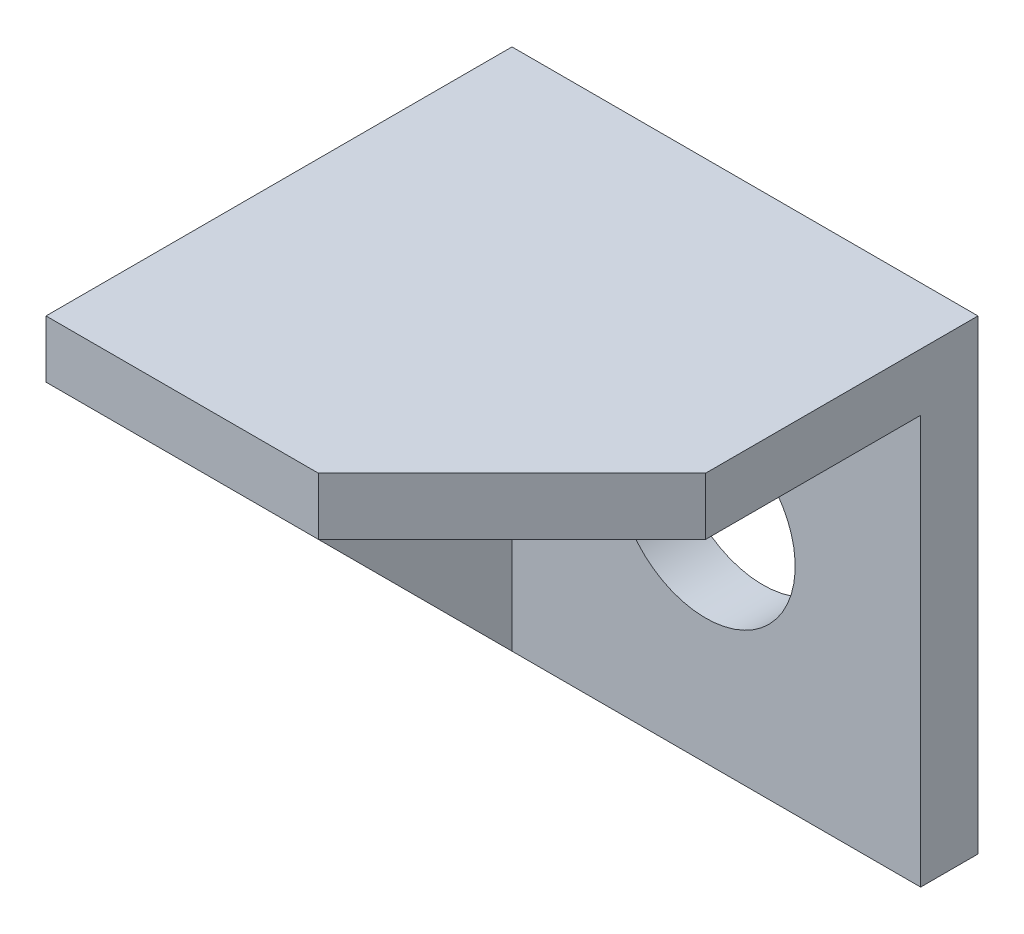
ISO-10303-21;
HEADER;
FILE_DESCRIPTION(('STEP AP214'),'2;1');
FILE_NAME('part.step','',(''),(''),'','','');
FILE_SCHEMA(('AUTOMOTIVE_DESIGN { 1 0 10303 214 1 1 1 1 }'));
ENDSEC;
DATA;
#1=APPLICATION_CONTEXT('core data for automotive mechanical design processes');
#2=APPLICATION_PROTOCOL_DEFINITION('international standard','automotive_design',2000,#1);
#3=PRODUCT_CONTEXT('',#1,'mechanical');
#4=PRODUCT('Part','Part','',(#3));
#5=PRODUCT_RELATED_PRODUCT_CATEGORY('part','',(#4));
#6=PRODUCT_DEFINITION_FORMATION('','',#4);
#7=PRODUCT_DEFINITION_CONTEXT('part definition',#1,'design');
#8=PRODUCT_DEFINITION('design','',#6,#7);
#9=PRODUCT_DEFINITION_SHAPE('','',#8);
#10=(LENGTH_UNIT() NAMED_UNIT(*) SI_UNIT(.MILLI.,.METRE.));
#11=(NAMED_UNIT(*) PLANE_ANGLE_UNIT() SI_UNIT($,.RADIAN.));
#12=(NAMED_UNIT(*) SI_UNIT($,.STERADIAN.) SOLID_ANGLE_UNIT());
#13=UNCERTAINTY_MEASURE_WITH_UNIT(LENGTH_MEASURE(1.E-05),#10,'distance_accuracy_value','');
#14=(GEOMETRIC_REPRESENTATION_CONTEXT(3) GLOBAL_UNCERTAINTY_ASSIGNED_CONTEXT((#13)) GLOBAL_UNIT_ASSIGNED_CONTEXT((#10,
#11,#12)) REPRESENTATION_CONTEXT('',''));
#15=CARTESIAN_POINT('',(0.,0.,0.));
#16=DIRECTION('',(0.,0.,1.));
#17=DIRECTION('',(1.,0.,0.));
#18=AXIS2_PLACEMENT_3D('',#15,#16,#17);
#19=CARTESIAN_POINT('',(32.5,-32.5,65.));
#20=DIRECTION('',(-1.,0.,0.));
#21=DIRECTION('',(0.,0.,1.));
#22=AXIS2_PLACEMENT_3D('',#19,#20,#21);
#23=PLANE('',#22);
#24=DIRECTION('',(0.,0.,-1.));
#25=VECTOR('',#24,1.);
#26=CARTESIAN_POINT('',(32.5,32.5,65.));
#27=LINE('',#26,#25);
#28=CARTESIAN_POINT('',(32.5,32.5,37.9999999999999));
#29=VERTEX_POINT('',#28);
#30=CARTESIAN_POINT('',(32.5,32.5,0.));
#31=VERTEX_POINT('',#30);
#32=EDGE_CURVE('E13',#29,#31,#27,.T.);
#33=ORIENTED_EDGE('',*,*,#32,.F.);
#34=DIRECTION('',(0.,-1.,0.));
#35=VECTOR('',#34,1.);
#36=CARTESIAN_POINT('',(32.5,32.5,37.9999999999999));
#37=LINE('',#36,#35);
#38=CARTESIAN_POINT('',(32.5,24.5,37.9999999999999));
#39=VERTEX_POINT('',#38);
#40=EDGE_CURVE('E181',#29,#39,#37,.T.);
#41=ORIENTED_EDGE('',*,*,#40,.T.);
#42=DIRECTION('',(0.,0.,1.));
#43=VECTOR('',#42,1.);
#44=CARTESIAN_POINT('',(32.5,24.5,8.));
#45=LINE('',#44,#43);
#46=CARTESIAN_POINT('',(32.5,24.5,8.));
#47=VERTEX_POINT('',#46);
#48=EDGE_CURVE('E216',#47,#39,#45,.T.);
#49=ORIENTED_EDGE('',*,*,#48,.F.);
#50=DIRECTION('',(0.,1.,0.));
#51=VECTOR('',#50,1.);
#52=CARTESIAN_POINT('',(32.5,24.5,8.));
#53=LINE('',#52,#51);
#54=CARTESIAN_POINT('',(32.5,-32.5,8.));
#55=VERTEX_POINT('',#54);
#56=EDGE_CURVE('E151',#55,#47,#53,.T.);
#57=ORIENTED_EDGE('',*,*,#56,.F.);
#58=DIRECTION('',(0.,0.,-1.));
#59=VECTOR('',#58,1.);
#60=CARTESIAN_POINT('',(32.5,-32.5,65.));
#61=LINE('',#60,#59);
#62=CARTESIAN_POINT('',(32.5,-32.5,0.));
#63=VERTEX_POINT('',#62);
#64=EDGE_CURVE('E107',#55,#63,#61,.T.);
#65=ORIENTED_EDGE('',*,*,#64,.T.);
#66=DIRECTION('',(0.,1.,0.));
#67=VECTOR('',#66,1.);
#68=CARTESIAN_POINT('',(32.5,-32.5,0.));
#69=LINE('',#68,#67);
#70=EDGE_CURVE('E121',#63,#31,#69,.T.);
#71=ORIENTED_EDGE('',*,*,#70,.T.);
#72=EDGE_LOOP('',(#33,#41,#49,#57,#65,#71));
#73=FACE_BOUND('',#72,.T.);
#74=ADVANCED_FACE('F51',(#73),#23,.F.);
#75=CARTESIAN_POINT('',(-32.5,32.5,65.));
#76=DIRECTION('',(0.,-1.,0.));
#77=DIRECTION('',(0.,0.,-1.));
#78=AXIS2_PLACEMENT_3D('',#75,#76,#77);
#79=PLANE('',#78);
#80=DIRECTION('',(-1.,0.,0.));
#81=VECTOR('',#80,1.);
#82=CARTESIAN_POINT('',(-32.5,32.5,65.));
#83=LINE('',#82,#81);
#84=CARTESIAN_POINT('',(5.5,32.5,65.));
#85=VERTEX_POINT('',#84);
#86=CARTESIAN_POINT('',(-32.5,32.5,65.));
#87=VERTEX_POINT('',#86);
#88=EDGE_CURVE('E75',#85,#87,#83,.T.);
#89=ORIENTED_EDGE('',*,*,#88,.F.);
#90=DIRECTION('',(0.707106781186547,0.,-0.707106781186549));
#91=VECTOR('',#90,1.);
#92=CARTESIAN_POINT('',(5.5,32.5,65.));
#93=LINE('',#92,#91);
#94=EDGE_CURVE('E179',#85,#29,#93,.T.);
#95=ORIENTED_EDGE('',*,*,#94,.T.);
#96=ORIENTED_EDGE('',*,*,#32,.T.);
#97=DIRECTION('',(-1.,0.,0.));
#98=VECTOR('',#97,1.);
#99=CARTESIAN_POINT('',(-32.5,32.5,0.));
#100=LINE('',#99,#98);
#101=CARTESIAN_POINT('',(-32.5,32.5,0.));
#102=VERTEX_POINT('',#101);
#103=EDGE_CURVE('E117',#31,#102,#100,.T.);
#104=ORIENTED_EDGE('',*,*,#103,.T.);
#105=DIRECTION('',(0.,0.,-1.));
#106=VECTOR('',#105,1.);
#107=CARTESIAN_POINT('',(-32.5,32.5,65.));
#108=LINE('',#107,#106);
#109=EDGE_CURVE('E60',#87,#102,#108,.T.);
#110=ORIENTED_EDGE('',*,*,#109,.F.);
#111=EDGE_LOOP('',(#89,#95,#96,#104,#110));
#112=FACE_BOUND('',#111,.T.);
#113=ADVANCED_FACE('F142',(#112),#79,.F.);
#114=CARTESIAN_POINT('',(-32.5,-32.5,65.));
#115=DIRECTION('',(1.,0.,0.));
#116=DIRECTION('',(0.,0.,-1.));
#117=AXIS2_PLACEMENT_3D('',#114,#115,#116);
#118=PLANE('',#117);
#119=DIRECTION('',(0.,0.,-1.));
#120=VECTOR('',#119,1.);
#121=CARTESIAN_POINT('',(-32.5,-32.5,65.));
#122=LINE('',#121,#120);
#123=CARTESIAN_POINT('',(-32.5,-32.5,8.));
#124=VERTEX_POINT('',#123);
#125=CARTESIAN_POINT('',(-32.5,-32.5,0.));
#126=VERTEX_POINT('',#125);
#127=EDGE_CURVE('E93',#124,#126,#122,.T.);
#128=ORIENTED_EDGE('',*,*,#127,.F.);
#129=DIRECTION('',(0.,0.707106781186548,0.707106781186548));
#130=VECTOR('',#129,1.);
#131=CARTESIAN_POINT('',(-32.5,24.5,65.));
#132=LINE('',#131,#130);
#133=CARTESIAN_POINT('',(-32.5,24.5,65.));
#134=VERTEX_POINT('',#133);
#135=EDGE_CURVE('E195',#124,#134,#132,.T.);
#136=ORIENTED_EDGE('',*,*,#135,.T.);
#137=DIRECTION('',(0.,-1.,0.));
#138=VECTOR('',#137,1.);
#139=CARTESIAN_POINT('',(-32.5,-32.5,65.));
#140=LINE('',#139,#138);
#141=EDGE_CURVE('E125',#87,#134,#140,.T.);
#142=ORIENTED_EDGE('',*,*,#141,.F.);
#143=ORIENTED_EDGE('',*,*,#109,.T.);
#144=DIRECTION('',(0.,-1.,0.));
#145=VECTOR('',#144,1.);
#146=CARTESIAN_POINT('',(-32.5,-32.5,0.));
#147=LINE('',#146,#145);
#148=EDGE_CURVE('E111',#102,#126,#147,.T.);
#149=ORIENTED_EDGE('',*,*,#148,.T.);
#150=EDGE_LOOP('',(#128,#136,#142,#143,#149));
#151=FACE_BOUND('',#150,.T.);
#152=ADVANCED_FACE('F112',(#151),#118,.F.);
#153=CARTESIAN_POINT('',(-32.5,-32.5,65.));
#154=DIRECTION('',(0.,1.,0.));
#155=DIRECTION('',(0.,0.,1.));
#156=AXIS2_PLACEMENT_3D('',#153,#154,#155);
#157=PLANE('',#156);
#158=DIRECTION('',(1.,0.,0.));
#159=VECTOR('',#158,1.);
#160=CARTESIAN_POINT('',(32.5,-32.5,8.));
#161=LINE('',#160,#159);
#162=CARTESIAN_POINT('',(-24.5,-32.5,8.));
#163=VERTEX_POINT('',#162);
#164=EDGE_CURVE('E154',#163,#55,#161,.T.);
#165=ORIENTED_EDGE('',*,*,#164,.F.);
#166=DIRECTION('',(1.,0.,0.));
#167=VECTOR('',#166,1.);
#168=CARTESIAN_POINT('',(-32.5,-32.5,8.));
#169=LINE('',#168,#167);
#170=EDGE_CURVE('E103',#124,#163,#169,.T.);
#171=ORIENTED_EDGE('',*,*,#170,.F.);
#172=ORIENTED_EDGE('',*,*,#127,.T.);
#173=DIRECTION('',(1.,0.,0.));
#174=VECTOR('',#173,1.);
#175=CARTESIAN_POINT('',(-32.5,-32.5,0.));
#176=LINE('',#175,#174);
#177=EDGE_CURVE('E99',#126,#63,#176,.T.);
#178=ORIENTED_EDGE('',*,*,#177,.T.);
#179=ORIENTED_EDGE('',*,*,#64,.F.);
#180=EDGE_LOOP('',(#165,#171,#172,#178,#179));
#181=FACE_BOUND('',#180,.T.);
#182=ADVANCED_FACE('F96',(#181),#157,.F.);
#183=CARTESIAN_POINT('',(0.,0.,65.));
#184=DIRECTION('',(0.,0.,-1.));
#185=DIRECTION('',(-1.,0.,0.));
#186=AXIS2_PLACEMENT_3D('',#183,#184,#185);
#187=PLANE('',#186);
#188=DIRECTION('',(-1.,0.,0.));
#189=VECTOR('',#188,1.);
#190=CARTESIAN_POINT('',(-24.5,24.5,65.));
#191=LINE('',#190,#189);
#192=CARTESIAN_POINT('',(5.5,24.5,65.));
#193=VERTEX_POINT('',#192);
#194=CARTESIAN_POINT('',(-24.5,24.5,65.));
#195=VERTEX_POINT('',#194);
#196=EDGE_CURVE('E187',#193,#195,#191,.T.);
#197=ORIENTED_EDGE('',*,*,#196,.F.);
#198=DIRECTION('',(0.,-1.,0.));
#199=VECTOR('',#198,1.);
#200=CARTESIAN_POINT('',(5.5,32.5,65.));
#201=LINE('',#200,#199);
#202=EDGE_CURVE('E67',#85,#193,#201,.T.);
#203=ORIENTED_EDGE('',*,*,#202,.F.);
#204=ORIENTED_EDGE('',*,*,#88,.T.);
#205=ORIENTED_EDGE('',*,*,#141,.T.);
#206=DIRECTION('',(1.,0.,0.));
#207=VECTOR('',#206,1.);
#208=CARTESIAN_POINT('',(-32.5,24.5,65.));
#209=LINE('',#208,#207);
#210=EDGE_CURVE('E200',#134,#195,#209,.T.);
#211=ORIENTED_EDGE('',*,*,#210,.T.);
#212=EDGE_LOOP('',(#197,#203,#204,#205,#211));
#213=FACE_BOUND('',#212,.T.);
#214=ADVANCED_FACE('F186',(#213),#187,.F.);
#215=CARTESIAN_POINT('',(0.,0.,0.));
#216=DIRECTION('',(0.,0.,-1.));
#217=DIRECTION('',(-1.,0.,0.));
#218=AXIS2_PLACEMENT_3D('',#215,#216,#217);
#219=PLANE('',#218);
#220=CARTESIAN_POINT('',(2.5,-2.5,0.));
#221=DIRECTION('',(0.,0.,-1.));
#222=DIRECTION('',(-1.,0.,0.));
#223=AXIS2_PLACEMENT_3D('',#220,#221,#222);
#224=CIRCLE('',#223,12.5);
#225=CARTESIAN_POINT('',(-10.,-2.5,0.));
#226=VERTEX_POINT('',#225);
#227=EDGE_CURVE('E304',#226,#226,#224,.T.);
#228=ORIENTED_EDGE('',*,*,#227,.F.);
#229=EDGE_LOOP('',(#228));
#230=FACE_BOUND('',#229,.T.);
#231=ORIENTED_EDGE('',*,*,#70,.F.);
#232=ORIENTED_EDGE('',*,*,#177,.F.);
#233=ORIENTED_EDGE('',*,*,#148,.F.);
#234=ORIENTED_EDGE('',*,*,#103,.F.);
#235=EDGE_LOOP('',(#231,#232,#233,#234));
#236=FACE_BOUND('',#235,.T.);
#237=ADVANCED_FACE('F119',(#230,#236),#219,.T.);
#238=CARTESIAN_POINT('',(-24.5,-32.5,8.));
#239=DIRECTION('',(-1.,0.,0.));
#240=DIRECTION('',(0.,0.,1.));
#241=AXIS2_PLACEMENT_3D('',#238,#239,#240);
#242=PLANE('',#241);
#243=DIRECTION('',(0.,0.,1.));
#244=VECTOR('',#243,1.);
#245=CARTESIAN_POINT('',(-24.5,24.5,8.));
#246=LINE('',#245,#244);
#247=CARTESIAN_POINT('',(-24.5,24.5,8.));
#248=VERTEX_POINT('',#247);
#249=EDGE_CURVE('E139',#248,#195,#246,.T.);
#250=ORIENTED_EDGE('',*,*,#249,.T.);
#251=DIRECTION('',(0.,0.707106781186548,0.707106781186548));
#252=VECTOR('',#251,1.);
#253=CARTESIAN_POINT('',(-24.5,24.5,65.));
#254=LINE('',#253,#252);
#255=EDGE_CURVE('E191',#163,#195,#254,.T.);
#256=ORIENTED_EDGE('',*,*,#255,.F.);
#257=DIRECTION('',(0.,-1.,0.));
#258=VECTOR('',#257,1.);
#259=CARTESIAN_POINT('',(-24.5,-32.5,8.));
#260=LINE('',#259,#258);
#261=EDGE_CURVE('E211',#248,#163,#260,.T.);
#262=ORIENTED_EDGE('',*,*,#261,.F.);
#263=EDGE_LOOP('',(#250,#256,#262));
#264=FACE_BOUND('',#263,.T.);
#265=ADVANCED_FACE('F236',(#264),#242,.F.);
#266=CARTESIAN_POINT('',(-24.5,24.5,8.));
#267=DIRECTION('',(0.,1.,0.));
#268=DIRECTION('',(0.,0.,1.));
#269=AXIS2_PLACEMENT_3D('',#266,#267,#268);
#270=PLANE('',#269);
#271=ORIENTED_EDGE('',*,*,#48,.T.);
#272=DIRECTION('',(0.707106781186547,0.,-0.707106781186549));
#273=VECTOR('',#272,1.);
#274=CARTESIAN_POINT('',(5.5,24.5,65.));
#275=LINE('',#274,#273);
#276=EDGE_CURVE('E183',#193,#39,#275,.T.);
#277=ORIENTED_EDGE('',*,*,#276,.F.);
#278=ORIENTED_EDGE('',*,*,#196,.T.);
#279=ORIENTED_EDGE('',*,*,#249,.F.);
#280=DIRECTION('',(-1.,0.,0.));
#281=VECTOR('',#280,1.);
#282=CARTESIAN_POINT('',(-24.5,24.5,8.));
#283=LINE('',#282,#281);
#284=EDGE_CURVE('E207',#47,#248,#283,.T.);
#285=ORIENTED_EDGE('',*,*,#284,.F.);
#286=EDGE_LOOP('',(#271,#277,#278,#279,#285));
#287=FACE_BOUND('',#286,.T.);
#288=ADVANCED_FACE('F224',(#287),#270,.F.);
#289=CARTESIAN_POINT('',(0.,0.,8.));
#290=DIRECTION('',(0.,0.,-1.));
#291=DIRECTION('',(-1.,0.,0.));
#292=AXIS2_PLACEMENT_3D('',#289,#290,#291);
#293=PLANE('',#292);
#294=CARTESIAN_POINT('',(2.5,-2.5,8.));
#295=DIRECTION('',(0.,0.,-1.));
#296=DIRECTION('',(-1.,0.,0.));
#297=AXIS2_PLACEMENT_3D('',#294,#295,#296);
#298=CIRCLE('',#297,12.5);
#299=CARTESIAN_POINT('',(-10.,-2.5,8.));
#300=VERTEX_POINT('',#299);
#301=EDGE_CURVE('E54',#300,#300,#298,.T.);
#302=ORIENTED_EDGE('',*,*,#301,.T.);
#303=EDGE_LOOP('',(#302));
#304=FACE_BOUND('',#303,.T.);
#305=ORIENTED_EDGE('',*,*,#56,.T.);
#306=ORIENTED_EDGE('',*,*,#284,.T.);
#307=ORIENTED_EDGE('',*,*,#261,.T.);
#308=ORIENTED_EDGE('',*,*,#164,.T.);
#309=EDGE_LOOP('',(#305,#306,#307,#308));
#310=FACE_BOUND('',#309,.T.);
#311=ADVANCED_FACE('F226',(#304,#310),#293,.F.);
#312=CARTESIAN_POINT('',(-32.5,24.5,65.));
#313=DIRECTION('',(0.,0.707106781186547,-0.707106781186547));
#314=DIRECTION('',(0.,0.707106781186548,0.707106781186548));
#315=AXIS2_PLACEMENT_3D('',#312,#313,#314);
#316=PLANE('',#315);
#317=ORIENTED_EDGE('',*,*,#255,.T.);
#318=ORIENTED_EDGE('',*,*,#210,.F.);
#319=ORIENTED_EDGE('',*,*,#135,.F.);
#320=ORIENTED_EDGE('',*,*,#170,.T.);
#321=EDGE_LOOP('',(#317,#318,#319,#320));
#322=FACE_BOUND('',#321,.T.);
#323=ADVANCED_FACE('F228',(#322),#316,.F.);
#324=CARTESIAN_POINT('',(5.5,32.5,65.));
#325=DIRECTION('',(-0.707106781186549,0.,-0.707106781186547));
#326=DIRECTION('',(-0.707106781186547,0.,0.707106781186549));
#327=AXIS2_PLACEMENT_3D('',#324,#325,#326);
#328=PLANE('',#327);
#329=ORIENTED_EDGE('',*,*,#276,.T.);
#330=ORIENTED_EDGE('',*,*,#40,.F.);
#331=ORIENTED_EDGE('',*,*,#94,.F.);
#332=ORIENTED_EDGE('',*,*,#202,.T.);
#333=EDGE_LOOP('',(#329,#330,#331,#332));
#334=FACE_BOUND('',#333,.T.);
#335=ADVANCED_FACE('F180',(#334),#328,.F.);
#336=CARTESIAN_POINT('',(2.5,-2.5,65.));
#337=DIRECTION('',(0.,0.,-1.));
#338=DIRECTION('',(-1.,0.,0.));
#339=AXIS2_PLACEMENT_3D('',#336,#337,#338);
#340=CYLINDRICAL_SURFACE('',#339,12.5);
#341=ORIENTED_EDGE('',*,*,#227,.T.);
#342=EDGE_LOOP('',(#341));
#343=FACE_BOUND('',#342,.T.);
#344=ORIENTED_EDGE('',*,*,#301,.F.);
#345=EDGE_LOOP('',(#344));
#346=FACE_BOUND('',#345,.T.);
#347=ADVANCED_FACE('F279',(#343,#346),#340,.F.);
#348=CLOSED_SHELL('',(#74,#113,#152,#182,#214,#237,#265,#288,#311,#323,#335,#347));
#349=MANIFOLD_SOLID_BREP('B2',#348);
#350=ADVANCED_BREP_SHAPE_REPRESENTATION('',(#18,#349),#14);
#351=SHAPE_DEFINITION_REPRESENTATION(#9,#350);
ENDSEC;
END-ISO-10303-21;
